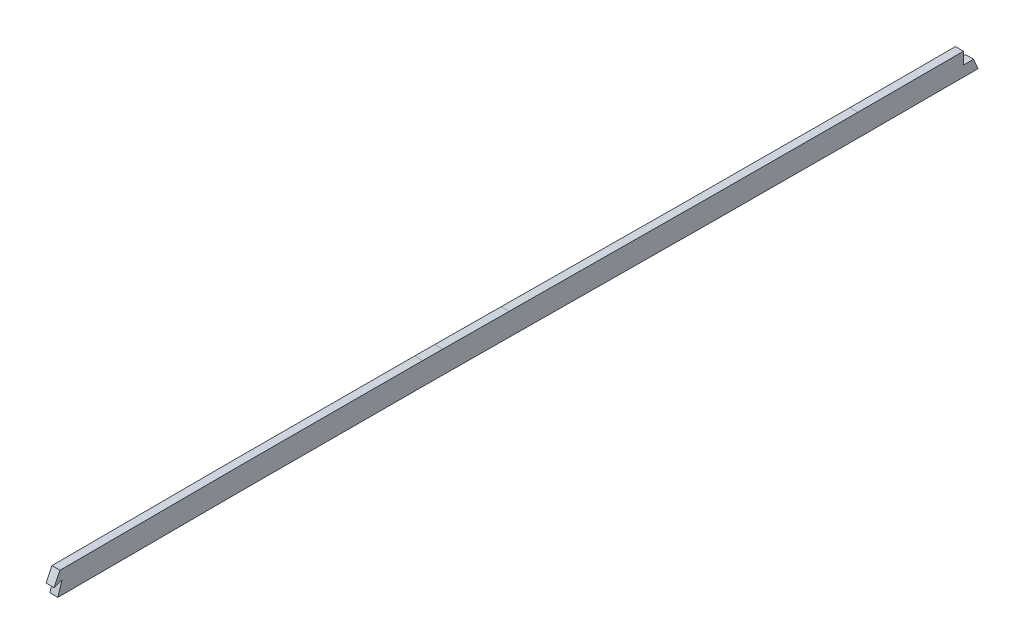
ISO-10303-21;
HEADER;
FILE_DESCRIPTION(('STEP AP214'),'2;1');
FILE_NAME('part.step','',(''),(''),'','','');
FILE_SCHEMA(('AUTOMOTIVE_DESIGN { 1 0 10303 214 1 1 1 1 }'));
ENDSEC;
DATA;
#1=APPLICATION_CONTEXT('core data for automotive mechanical design processes');
#2=APPLICATION_PROTOCOL_DEFINITION('international standard','automotive_design',2000,#1);
#3=PRODUCT_CONTEXT('',#1,'mechanical');
#4=PRODUCT('Part','Part','',(#3));
#5=PRODUCT_RELATED_PRODUCT_CATEGORY('part','',(#4));
#6=PRODUCT_DEFINITION_FORMATION('','',#4);
#7=PRODUCT_DEFINITION_CONTEXT('part definition',#1,'design');
#8=PRODUCT_DEFINITION('design','',#6,#7);
#9=PRODUCT_DEFINITION_SHAPE('','',#8);
#10=(LENGTH_UNIT() NAMED_UNIT(*) SI_UNIT(.MILLI.,.METRE.));
#11=(NAMED_UNIT(*) PLANE_ANGLE_UNIT() SI_UNIT($,.RADIAN.));
#12=(NAMED_UNIT(*) SI_UNIT($,.STERADIAN.) SOLID_ANGLE_UNIT());
#13=UNCERTAINTY_MEASURE_WITH_UNIT(LENGTH_MEASURE(1.E-05),#10,'distance_accuracy_value','');
#14=(GEOMETRIC_REPRESENTATION_CONTEXT(3) GLOBAL_UNCERTAINTY_ASSIGNED_CONTEXT((#13)) GLOBAL_UNIT_ASSIGNED_CONTEXT((#10,
#11,#12)) REPRESENTATION_CONTEXT('',''));
#15=CARTESIAN_POINT('',(0.,0.,0.));
#16=DIRECTION('',(0.,0.,1.));
#17=DIRECTION('',(1.,0.,0.));
#18=AXIS2_PLACEMENT_3D('',#15,#16,#17);
#19=CARTESIAN_POINT('',(-1.5875,129.578409662079,-768.73504864351));
#20=CARTESIAN_POINT('',(-1.5875,129.562145519502,-797.222409768422));
#21=CARTESIAN_POINT('',(-1.5875,129.725124502773,-854.203652026176));
#22=CARTESIAN_POINT('',(-1.5875,130.236578517582,-939.635195481091));
#23=CARTESIAN_POINT('',(-1.5875,130.524931921096,-1024.99295846428));
#24=CARTESIAN_POINT('',(-1.5875,130.426767717012,-1081.93761233553));
#25=CARTESIAN_POINT('',(-1.5875,130.38454577414,-1110.40497093677));
#26=B_SPLINE_CURVE_WITH_KNOTS('',3,(#19,#20,#21,#22,#23,#24,#25),.UNSPECIFIED.,.F.,.F.,(4,1,1,1,
4),(0.,0.25,0.5,0.75,1.),.UNSPECIFIED.);
#27=DIRECTION('',(1.,0.,0.));
#28=VECTOR('',#27,1.);
#29=SURFACE_OF_LINEAR_EXTRUSION('',#26,#28);
#30=DIRECTION('',(1.,0.,0.));
#31=VECTOR('',#30,1.);
#32=CARTESIAN_POINT('',(-6.0325,129.632745347889,-816.238424634587));
#33=LINE('',#32,#31);
#34=CARTESIAN_POINT('',(-1.5875,129.632745347889,-816.238424634587));
#35=VERTEX_POINT('',#34);
#36=CARTESIAN_POINT('',(1.5875,129.632745347889,-816.238424634587));
#37=VERTEX_POINT('',#36);
#38=EDGE_CURVE('E441',#35,#37,#33,.T.);
#39=ORIENTED_EDGE('',*,*,#38,.T.);
#40=CARTESIAN_POINT('',(1.5875,129.578409662079,-768.73504864351));
#41=CARTESIAN_POINT('',(1.5875,129.562145519502,-797.222409768422));
#42=CARTESIAN_POINT('',(1.5875,129.725124502773,-854.203652026176));
#43=CARTESIAN_POINT('',(1.5875,130.236578517582,-939.635195481091));
#44=CARTESIAN_POINT('',(1.5875,130.524931921096,-1024.99295846428));
#45=CARTESIAN_POINT('',(1.5875,130.426767717012,-1081.93761233553));
#46=CARTESIAN_POINT('',(1.5875,130.38454577414,-1110.40497093677));
#47=B_SPLINE_CURVE_WITH_KNOTS('',3,(#40,#41,#42,#43,#44,#45,#46),.UNSPECIFIED.,.F.,.F.,(4,1,1,1,
4),(0.,0.25,0.5,0.75,1.),.UNSPECIFIED.);
#48=CARTESIAN_POINT('',(1.5875,129.578409662079,-768.735048644377));
#49=VERTEX_POINT('',#48);
#50=EDGE_CURVE('E341',#49,#37,#47,.T.);
#51=ORIENTED_EDGE('',*,*,#50,.F.);
#52=DIRECTION('',(1.,0.,0.));
#53=VECTOR('',#52,1.);
#54=CARTESIAN_POINT('',(-1.5875,129.578409662079,-768.735048644377));
#55=LINE('',#54,#53);
#56=CARTESIAN_POINT('',(-1.5875,129.578409662079,-768.735048644377));
#57=VERTEX_POINT('',#56);
#58=EDGE_CURVE('E11',#57,#49,#55,.T.);
#59=ORIENTED_EDGE('',*,*,#58,.F.);
#60=EDGE_CURVE('E396',#57,#35,#26,.T.);
#61=ORIENTED_EDGE('',*,*,#60,.T.);
#62=EDGE_LOOP('',(#39,#51,#59,#61));
#63=FACE_BOUND('',#62,.T.);
#64=ADVANCED_FACE('F40',(#63),#29,.T.);
#65=CARTESIAN_POINT('',(-1.5875,130.361698314933,-630.710339689829));
#66=CARTESIAN_POINT('',(-1.5875,130.273644325736,-642.206126488968));
#67=CARTESIAN_POINT('',(-1.5875,130.083785310893,-665.193556095248));
#68=CARTESIAN_POINT('',(-1.5875,129.819212192808,-699.699077952938));
#69=CARTESIAN_POINT('',(-1.5875,129.634735150848,-734.215040109625));
#70=CARTESIAN_POINT('',(-1.5875,129.584978980173,-757.22859707547));
#71=CARTESIAN_POINT('',(-1.5875,129.578409662079,-768.735048644377));
#72=B_SPLINE_CURVE_WITH_KNOTS('',3,(#65,#66,#67,#68,#69,#70,#71),.UNSPECIFIED.,.F.,.F.,(4,1,1,1,
4),(0.,0.25,0.5,0.75,1.),.UNSPECIFIED.);
#73=DIRECTION('',(1.,0.,0.));
#74=VECTOR('',#73,1.);
#75=SURFACE_OF_LINEAR_EXTRUSION('',#72,#74);
#76=CARTESIAN_POINT('',(1.5875,130.361698314933,-630.710339689829));
#77=CARTESIAN_POINT('',(1.5875,130.273644325736,-642.206126488968));
#78=CARTESIAN_POINT('',(1.5875,130.083785310893,-665.193556095248));
#79=CARTESIAN_POINT('',(1.5875,129.819212192808,-699.699077952938));
#80=CARTESIAN_POINT('',(1.5875,129.634735150848,-734.215040109625));
#81=CARTESIAN_POINT('',(1.5875,129.584978980173,-757.22859707547));
#82=CARTESIAN_POINT('',(1.5875,129.578409662079,-768.735048644377));
#83=B_SPLINE_CURVE_WITH_KNOTS('',3,(#76,#77,#78,#79,#80,#81,#82),.UNSPECIFIED.,.F.,.F.,(4,1,1,1,
4),(0.,0.25,0.5,0.75,1.),.UNSPECIFIED.);
#84=CARTESIAN_POINT('',(1.5875,130.361698324048,-630.710338499818));
#85=VERTEX_POINT('',#84);
#86=EDGE_CURVE('E347',#85,#49,#83,.T.);
#87=ORIENTED_EDGE('',*,*,#86,.F.);
#88=DIRECTION('',(1.,0.,0.));
#89=VECTOR('',#88,1.);
#90=CARTESIAN_POINT('',(-1.5875,130.361698324048,-630.710338499818));
#91=LINE('',#90,#89);
#92=CARTESIAN_POINT('',(-1.5875,130.361698324048,-630.710338499818));
#93=VERTEX_POINT('',#92);
#94=EDGE_CURVE('E53',#93,#85,#91,.T.);
#95=ORIENTED_EDGE('',*,*,#94,.F.);
#96=EDGE_CURVE('E406',#93,#57,#72,.T.);
#97=ORIENTED_EDGE('',*,*,#96,.T.);
#98=ORIENTED_EDGE('',*,*,#58,.T.);
#99=EDGE_LOOP('',(#87,#95,#97,#98));
#100=FACE_BOUND('',#99,.T.);
#101=ADVANCED_FACE('F423',(#100),#75,.T.);
#102=CARTESIAN_POINT('',(-1.5875,130.543849997921,-604.460914456542));
#103=CARTESIAN_POINT('',(-1.5875,130.530551361573,-606.648150430552));
#104=CARTESIAN_POINT('',(-1.5875,130.502867011444,-611.022503016699));
#105=CARTESIAN_POINT('',(-1.5875,130.458405464686,-617.584689428613));
#106=CARTESIAN_POINT('',(-1.5875,130.411339888287,-624.147187284148));
#107=CARTESIAN_POINT('',(-1.5875,130.378455493813,-628.522663801703));
#108=CARTESIAN_POINT('',(-1.5875,130.361698324048,-630.710338499818));
#109=B_SPLINE_CURVE_WITH_KNOTS('',3,(#102,#103,#104,#105,#106,#107,#108),.UNSPECIFIED.,.F.,.F.,
(4,1,1,1,4),(-7.08953406117068E-07,0.249999468284945,0.499999645523297,0.749999822761648,1.),.UNSPECIFIED.);
#110=DIRECTION('',(1.,0.,0.));
#111=VECTOR('',#110,1.);
#112=SURFACE_OF_LINEAR_EXTRUSION('',#109,#111);
#113=CARTESIAN_POINT('',(1.5875,130.543849997921,-604.460914456542));
#114=CARTESIAN_POINT('',(1.5875,130.530551361573,-606.648150430552));
#115=CARTESIAN_POINT('',(1.5875,130.502867011444,-611.022503016699));
#116=CARTESIAN_POINT('',(1.5875,130.458405464686,-617.584689428613));
#117=CARTESIAN_POINT('',(1.5875,130.411339888287,-624.147187284148));
#118=CARTESIAN_POINT('',(1.5875,130.378455493813,-628.522663801703));
#119=CARTESIAN_POINT('',(1.5875,130.361698324048,-630.710338499818));
#120=B_SPLINE_CURVE_WITH_KNOTS('',3,(#113,#114,#115,#116,#117,#118,#119),.UNSPECIFIED.,.F.,.F.,
(4,1,1,1,4),(-7.08953406117068E-07,0.249999468284945,0.499999645523297,0.749999822761648,1.),.UNSPECIFIED.);
#121=CARTESIAN_POINT('',(1.5875,130.543849997922,-604.460914456541));
#122=VERTEX_POINT('',#121);
#123=EDGE_CURVE('E353',#122,#85,#120,.T.);
#124=ORIENTED_EDGE('',*,*,#123,.F.);
#125=DIRECTION('',(1.,0.,0.));
#126=VECTOR('',#125,1.);
#127=CARTESIAN_POINT('',(-1.5875,130.543849997922,-604.460914456541));
#128=LINE('',#127,#126);
#129=CARTESIAN_POINT('',(-1.5875,130.543849997922,-604.460914456541));
#130=VERTEX_POINT('',#129);
#131=EDGE_CURVE('E366',#130,#122,#128,.T.);
#132=ORIENTED_EDGE('',*,*,#131,.F.);
#133=EDGE_CURVE('E416',#130,#93,#109,.T.);
#134=ORIENTED_EDGE('',*,*,#133,.T.);
#135=ORIENTED_EDGE('',*,*,#94,.T.);
#136=EDGE_LOOP('',(#124,#132,#134,#135));
#137=FACE_BOUND('',#136,.T.);
#138=ADVANCED_FACE('F426',(#137),#112,.T.);
#139=CARTESIAN_POINT('',(-1.5875,-12134.2803031365,-529.837683130908));
#140=DIRECTION('',(1.,0.,0.));
#141=DIRECTION('',(0.,0.,-1.));
#142=AXIS2_PLACEMENT_3D('',#139,#140,#141);
#143=CYLINDRICAL_SURFACE('',#142,12265.0511671971);
#144=CARTESIAN_POINT('',(1.5875,-12134.2803031365,-529.837683130908));
#145=DIRECTION('',(1.,0.,0.));
#146=DIRECTION('',(0.,0.,-1.));
#147=AXIS2_PLACEMENT_3D('',#144,#145,#146);
#148=CIRCLE('',#147,12265.0511671971);
#149=CARTESIAN_POINT('',(1.5875,130.589510646411,-596.53539613264));
#150=VERTEX_POINT('',#149);
#151=EDGE_CURVE('E380',#122,#150,#148,.T.);
#152=ORIENTED_EDGE('',*,*,#151,.T.);
#153=DIRECTION('',(1.,0.,0.));
#154=VECTOR('',#153,1.);
#155=CARTESIAN_POINT('',(-1.5875,130.589510646411,-596.53539613264));
#156=LINE('',#155,#154);
#157=CARTESIAN_POINT('',(-1.5875,130.589510646411,-596.53539613264));
#158=VERTEX_POINT('',#157);
#159=EDGE_CURVE('E322',#158,#150,#156,.T.);
#160=ORIENTED_EDGE('',*,*,#159,.F.);
#161=CARTESIAN_POINT('',(-1.5875,-12134.2803031365,-529.837683130908));
#162=DIRECTION('',(1.,0.,0.));
#163=DIRECTION('',(0.,0.,-1.));
#164=AXIS2_PLACEMENT_3D('',#161,#162,#163);
#165=CIRCLE('',#164,12265.0511671971);
#166=EDGE_CURVE('E590',#130,#158,#165,.T.);
#167=ORIENTED_EDGE('',*,*,#166,.F.);
#168=ORIENTED_EDGE('',*,*,#131,.T.);
#169=EDGE_LOOP('',(#152,#160,#167,#168));
#170=FACE_BOUND('',#169,.T.);
#171=ADVANCED_FACE('F381',(#170),#143,.F.);
#172=CARTESIAN_POINT('',(-1.5875,130.467204420765,-436.155274925161));
#173=CARTESIAN_POINT('',(-1.5875,130.500683926665,-449.528322362865));
#174=CARTESIAN_POINT('',(-1.5875,130.546633814902,-476.275740381745));
#175=CARTESIAN_POINT('',(-1.5875,130.728798696969,-516.38896028979));
#176=CARTESIAN_POINT('',(-1.5875,130.759667497616,-556.456290894868));
#177=CARTESIAN_POINT('',(-1.5875,130.662101975378,-583.176533447977));
#178=CARTESIAN_POINT('',(-1.5875,130.589510646413,-596.53539613264));
#179=B_SPLINE_CURVE_WITH_KNOTS('',3,(#172,#173,#174,#175,#176,#177,#178),.UNSPECIFIED.,.F.,.F.,
(4,1,1,1,4),(0.,0.249999972809526,0.499999945619052,0.749999918428578,0.999999891238104),.UNSPECIFIED.);
#180=DIRECTION('',(1.,0.,0.));
#181=VECTOR('',#180,1.);
#182=SURFACE_OF_LINEAR_EXTRUSION('',#179,#181);
#183=DIRECTION('',(1.,0.,0.));
#184=VECTOR('',#183,1.);
#185=CARTESIAN_POINT('',(-6.0325,130.504363999303,-452.268768997127));
#186=LINE('',#185,#184);
#187=CARTESIAN_POINT('',(-1.5875,130.504363999303,-452.268768997127));
#188=VERTEX_POINT('',#187);
#189=CARTESIAN_POINT('',(1.5875,130.504363999303,-452.268768997127));
#190=VERTEX_POINT('',#189);
#191=EDGE_CURVE('E178',#188,#190,#186,.T.);
#192=ORIENTED_EDGE('',*,*,#191,.F.);
#193=EDGE_CURVE('E293',#188,#158,#179,.T.);
#194=ORIENTED_EDGE('',*,*,#193,.T.);
#195=ORIENTED_EDGE('',*,*,#159,.T.);
#196=CARTESIAN_POINT('',(1.5875,130.467204420765,-436.155274925161));
#197=CARTESIAN_POINT('',(1.5875,130.500683926665,-449.528322362865));
#198=CARTESIAN_POINT('',(1.5875,130.546633814902,-476.275740381745));
#199=CARTESIAN_POINT('',(1.5875,130.728798696969,-516.38896028979));
#200=CARTESIAN_POINT('',(1.5875,130.759667497616,-556.456290894868));
#201=CARTESIAN_POINT('',(1.5875,130.662101975378,-583.176533447977));
#202=CARTESIAN_POINT('',(1.5875,130.589510646413,-596.53539613264));
#203=B_SPLINE_CURVE_WITH_KNOTS('',3,(#196,#197,#198,#199,#200,#201,#202),.UNSPECIFIED.,.F.,.F.,
(4,1,1,1,4),(0.,0.249999972809526,0.499999945619052,0.749999918428578,0.999999891238104),.UNSPECIFIED.);
#204=EDGE_CURVE('E188',#190,#150,#203,.T.);
#205=ORIENTED_EDGE('',*,*,#204,.F.);
#206=EDGE_LOOP('',(#192,#194,#195,#205));
#207=FACE_BOUND('',#206,.T.);
#208=ADVANCED_FACE('F305',(#207),#182,.T.);
#209=CARTESIAN_POINT('',(-1.5875,139.357176561668,-436.133018825636));
#210=CARTESIAN_POINT('',(-1.5875,139.390650738922,-449.503937790031));
#211=CARTESIAN_POINT('',(-1.5875,139.412366015163,-462.874888934299));
#212=CARTESIAN_POINT('',(-1.5875,139.49855597718,-489.616659390037));
#213=CARTESIAN_POINT('',(-1.5875,139.559076552839,-502.98749712742));
#214=CARTESIAN_POINT('',(-1.5875,139.628029753523,-529.729299232511));
#215=CARTESIAN_POINT('',(-1.5875,139.639230481059,-543.100240500853));
#216=CARTESIAN_POINT('',(-1.5875,139.601013959494,-569.842121019924));
#217=CARTESIAN_POINT('',(-1.5875,139.552035302235,-583.212960696413));
#218=CARTESIAN_POINT('',(-1.5875,139.479379303594,-596.583720643824));
#219=B_SPLINE_CURVE_WITH_KNOTS('',3,(#209,#210,#211,#212,#213,#214,#215,#216,#217,#218),
.UNSPECIFIED.,.F.,.F.,(4,2,2,2,4),(0.,0.25,0.5,0.75,1.),.UNSPECIFIED.);
#220=DIRECTION('',(1.,0.,0.));
#221=VECTOR('',#220,1.);
#222=SURFACE_OF_LINEAR_EXTRUSION('',#219,#221);
#223=CARTESIAN_POINT('',(-1.5875,139.479379303594,-596.583720643824));
#224=CARTESIAN_POINT('',(-1.5875,139.552035302235,-583.212960696413));
#225=CARTESIAN_POINT('',(-1.5875,139.601013959494,-569.842121019924));
#226=CARTESIAN_POINT('',(-1.5875,139.639230481059,-543.100240500853));
#227=CARTESIAN_POINT('',(-1.5875,139.628029753523,-529.729299232511));
#228=CARTESIAN_POINT('',(-1.5875,139.559076552839,-502.98749712742));
#229=CARTESIAN_POINT('',(-1.5875,139.49855597718,-489.616659390037));
#230=CARTESIAN_POINT('',(-1.5875,139.430581917439,-468.526654707202));
#231=CARTESIAN_POINT('',(-1.5875,139.412828364317,-460.807513283317));
#232=CARTESIAN_POINT('',(-1.5875,139.395824208684,-453.088368765007));
#233=B_SPLINE_CURVE_WITH_KNOTS('',3,(#223,#224,#225,#226,#227,#228,#229,#230,#231,#232),
.UNSPECIFIED.,.F.,.F.,(4,2,2,2,4),(0.105672991664054,0.355672991664054,0.605672991664054,
0.855672991664054,1.),.UNSPECIFIED.);
#234=CARTESIAN_POINT('',(-1.5875,139.395862417181,-453.088368680839));
#235=VERTEX_POINT('',#234);
#236=CARTESIAN_POINT('',(-1.5875,139.479379303594,-596.583720643825));
#237=VERTEX_POINT('',#236);
#238=EDGE_CURVE('E176',#235,#237,#233,.F.);
#239=ORIENTED_EDGE('',*,*,#238,.F.);
#240=DIRECTION('',(1.,0.,0.));
#241=VECTOR('',#240,1.);
#242=CARTESIAN_POINT('',(-6.0325,139.395824167336,-453.088349994794));
#243=LINE('',#242,#241);
#244=CARTESIAN_POINT('',(1.5875,139.395807036751,-453.088341588638));
#245=VERTEX_POINT('',#244);
#246=EDGE_CURVE('E162',#235,#245,#243,.T.);
#247=ORIENTED_EDGE('',*,*,#246,.T.);
#248=CARTESIAN_POINT('',(1.5875,139.395824148735,-453.08834155065));
#249=CARTESIAN_POINT('',(1.5875,139.412828322589,-460.80749514042));
#250=CARTESIAN_POINT('',(1.5875,139.430581888201,-468.526645635779));
#251=CARTESIAN_POINT('',(1.5875,139.49855597718,-489.616659390037));
#252=CARTESIAN_POINT('',(1.5875,139.559076552839,-502.98749712742));
#253=CARTESIAN_POINT('',(1.5875,139.628029753523,-529.729299232511));
#254=CARTESIAN_POINT('',(1.5875,139.639230481059,-543.100240500853));
#255=CARTESIAN_POINT('',(1.5875,139.601013959494,-569.842121019924));
#256=CARTESIAN_POINT('',(1.5875,139.552035302235,-583.212960696413));
#257=CARTESIAN_POINT('',(1.5875,139.479379303594,-596.583720643824));
#258=B_SPLINE_CURVE_WITH_KNOTS('',3,(#248,#249,#250,#251,#252,#253,#254,#255,#256,#257),
.UNSPECIFIED.,.F.,.F.,(4,2,2,2,4),(0.105672822052567,0.25,0.5,0.75,1.),.UNSPECIFIED.);
#259=CARTESIAN_POINT('',(1.5875,139.479379303594,-596.583720643825));
#260=VERTEX_POINT('',#259);
#261=EDGE_CURVE('E173',#245,#260,#258,.T.);
#262=ORIENTED_EDGE('',*,*,#261,.T.);
#263=DIRECTION('',(1.,0.,0.));
#264=VECTOR('',#263,1.);
#265=CARTESIAN_POINT('',(-1.5875,139.479379303594,-596.583720643825));
#266=LINE('',#265,#264);
#267=EDGE_CURVE('E314',#237,#260,#266,.T.);
#268=ORIENTED_EDGE('',*,*,#267,.F.);
#269=EDGE_LOOP('',(#239,#247,#262,#268));
#270=FACE_BOUND('',#269,.T.);
#271=ADVANCED_FACE('F171',(#270),#222,.F.);
#272=CARTESIAN_POINT('',(-1.5875,-12134.2803031365,-529.837683130908));
#273=DIRECTION('',(1.,0.,0.));
#274=DIRECTION('',(0.,0.,-1.));
#275=AXIS2_PLACEMENT_3D('',#272,#273,#274);
#276=CYLINDRICAL_SURFACE('',#275,12273.9411671971);
#277=CARTESIAN_POINT('',(1.5875,-12134.2803031365,-529.837683130908));
#278=DIRECTION('',(1.,0.,0.));
#279=DIRECTION('',(0.,0.,-1.));
#280=AXIS2_PLACEMENT_3D('',#277,#278,#279);
#281=CIRCLE('',#280,12273.9411671971);
#282=CARTESIAN_POINT('',(1.5875,139.433685567646,-604.51498425923));
#283=VERTEX_POINT('',#282);
#284=EDGE_CURVE('E186',#283,#260,#281,.T.);
#285=ORIENTED_EDGE('',*,*,#284,.F.);
#286=DIRECTION('',(1.,0.,0.));
#287=VECTOR('',#286,1.);
#288=CARTESIAN_POINT('',(-1.5875,139.433685567646,-604.51498425923));
#289=LINE('',#288,#287);
#290=CARTESIAN_POINT('',(-1.5875,139.433685567646,-604.51498425923));
#291=VERTEX_POINT('',#290);
#292=EDGE_CURVE('E323',#291,#283,#289,.T.);
#293=ORIENTED_EDGE('',*,*,#292,.F.);
#294=CARTESIAN_POINT('',(-1.5875,-12134.2803031365,-529.837683130908));
#295=DIRECTION('',(1.,0.,0.));
#296=DIRECTION('',(0.,0.,-1.));
#297=AXIS2_PLACEMENT_3D('',#294,#295,#296);
#298=CIRCLE('',#297,12273.9411671971);
#299=EDGE_CURVE('E326',#291,#237,#298,.T.);
#300=ORIENTED_EDGE('',*,*,#299,.T.);
#301=ORIENTED_EDGE('',*,*,#267,.T.);
#302=EDGE_LOOP('',(#285,#293,#300,#301));
#303=FACE_BOUND('',#302,.T.);
#304=ADVANCED_FACE('F304',(#303),#276,.T.);
#305=CARTESIAN_POINT('',(-1.5875,139.433685567648,-604.51498425923));
#306=CARTESIAN_POINT('',(-1.5875,139.400696354289,-609.940743135861));
#307=CARTESIAN_POINT('',(-1.5875,139.342071397165,-618.69524242686));
#308=CARTESIAN_POINT('',(-1.5875,139.276935028131,-627.449694696427));
#309=CARTESIAN_POINT('',(-1.5875,139.251437535507,-630.778432201892));
#310=B_SPLINE_CURVE_WITH_KNOTS('',3,(#305,#306,#307,#308,#309),.UNSPECIFIED.,.F.,.F.,(4,1,4),
(0.,0.619765686067694,1.),.UNSPECIFIED.);
#311=DIRECTION('',(1.,0.,0.));
#312=VECTOR('',#311,1.);
#313=SURFACE_OF_LINEAR_EXTRUSION('',#310,#312);
#314=CARTESIAN_POINT('',(1.5875,139.433685567648,-604.51498425923));
#315=CARTESIAN_POINT('',(1.5875,139.400696354289,-609.940743135861));
#316=CARTESIAN_POINT('',(1.5875,139.342071397165,-618.69524242686));
#317=CARTESIAN_POINT('',(1.5875,139.276935028131,-627.449694696427));
#318=CARTESIAN_POINT('',(1.5875,139.251437535507,-630.778432201892));
#319=B_SPLINE_CURVE_WITH_KNOTS('',3,(#314,#315,#316,#317,#318),.UNSPECIFIED.,.F.,.F.,(4,1,4),
(0.,0.619765686067694,1.),.UNSPECIFIED.);
#320=CARTESIAN_POINT('',(1.5875,139.251437535507,-630.778432201892));
#321=VERTEX_POINT('',#320);
#322=EDGE_CURVE('E507',#283,#321,#319,.T.);
#323=ORIENTED_EDGE('',*,*,#322,.T.);
#324=DIRECTION('',(1.,0.,0.));
#325=VECTOR('',#324,1.);
#326=CARTESIAN_POINT('',(-1.5875,139.251437535507,-630.778432201892));
#327=LINE('',#326,#325);
#328=CARTESIAN_POINT('',(-1.5875,139.251437535507,-630.778432201892));
#329=VERTEX_POINT('',#328);
#330=EDGE_CURVE('E514',#329,#321,#327,.T.);
#331=ORIENTED_EDGE('',*,*,#330,.F.);
#332=CARTESIAN_POINT('',(-1.5875,139.251437535507,-630.778432201892));
#333=CARTESIAN_POINT('',(-1.5875,139.276935028131,-627.449694696427));
#334=CARTESIAN_POINT('',(-1.5875,139.342071397165,-618.69524242686));
#335=CARTESIAN_POINT('',(-1.5875,139.400696354289,-609.940743135861));
#336=CARTESIAN_POINT('',(-1.5875,139.433685567648,-604.51498425923));
#337=B_SPLINE_CURVE_WITH_KNOTS('',3,(#332,#333,#334,#335,#336),.UNSPECIFIED.,.F.,.F.,(4,1,4),
(0.,0.380234313932306,1.),.UNSPECIFIED.);
#338=EDGE_CURVE('E329',#291,#329,#337,.F.);
#339=ORIENTED_EDGE('',*,*,#338,.F.);
#340=ORIENTED_EDGE('',*,*,#292,.T.);
#341=EDGE_LOOP('',(#323,#331,#339,#340));
#342=FACE_BOUND('',#341,.T.);
#343=ADVANCED_FACE('F267',(#342),#313,.F.);
#344=CARTESIAN_POINT('',(-1.5875,139.251437535507,-630.778432201892));
#345=CARTESIAN_POINT('',(-1.5875,139.075315663891,-653.771819613578));
#346=CARTESIAN_POINT('',(-1.5875,138.871740519015,-676.765000849425));
#347=CARTESIAN_POINT('',(-1.5875,138.647690701073,-711.255349111164));
#348=CARTESIAN_POINT('',(-1.5875,138.586174182217,-722.752238944669));
#349=CARTESIAN_POINT('',(-1.5875,138.499784896072,-745.746099073854));
#350=CARTESIAN_POINT('',(-1.5875,138.474972157952,-757.243084258704));
#351=CARTESIAN_POINT('',(-1.5875,138.468408213209,-768.740124164662));
#352=B_SPLINE_CURVE_WITH_KNOTS('',3,(#344,#345,#346,#347,#348,#349,#350,#351),.UNSPECIFIED.,.F.,
.F.,(4,2,2,4),(0.,0.5,0.75,1.),.UNSPECIFIED.);
#353=DIRECTION('',(1.,0.,0.));
#354=VECTOR('',#353,1.);
#355=SURFACE_OF_LINEAR_EXTRUSION('',#352,#354);
#356=CARTESIAN_POINT('',(1.5875,139.251437535507,-630.778432201892));
#357=CARTESIAN_POINT('',(1.5875,139.075315663891,-653.771819613578));
#358=CARTESIAN_POINT('',(1.5875,138.871740519015,-676.765000849425));
#359=CARTESIAN_POINT('',(1.5875,138.647690701073,-711.255349111164));
#360=CARTESIAN_POINT('',(1.5875,138.586174182217,-722.752238944669));
#361=CARTESIAN_POINT('',(1.5875,138.499784896072,-745.746099073854));
#362=CARTESIAN_POINT('',(1.5875,138.474972157952,-757.243084258704));
#363=CARTESIAN_POINT('',(1.5875,138.468408213209,-768.740124164662));
#364=B_SPLINE_CURVE_WITH_KNOTS('',3,(#356,#357,#358,#359,#360,#361,#362,#363),.UNSPECIFIED.,.F.,
.F.,(4,2,2,4),(0.,0.5,0.75,1.),.UNSPECIFIED.);
#365=CARTESIAN_POINT('',(1.5875,138.468408213209,-768.740124164662));
#366=VERTEX_POINT('',#365);
#367=EDGE_CURVE('E501',#321,#366,#364,.T.);
#368=ORIENTED_EDGE('',*,*,#367,.T.);
#369=DIRECTION('',(1.,0.,0.));
#370=VECTOR('',#369,1.);
#371=CARTESIAN_POINT('',(-1.5875,138.468408213209,-768.740124164662));
#372=LINE('',#371,#370);
#373=CARTESIAN_POINT('',(-1.5875,138.468408213209,-768.740124164662));
#374=VERTEX_POINT('',#373);
#375=EDGE_CURVE('E255',#374,#366,#372,.T.);
#376=ORIENTED_EDGE('',*,*,#375,.F.);
#377=CARTESIAN_POINT('',(-1.5875,138.468408213209,-768.740124164662));
#378=CARTESIAN_POINT('',(-1.5875,138.474972157952,-757.243084258704));
#379=CARTESIAN_POINT('',(-1.5875,138.499784896072,-745.746099073854));
#380=CARTESIAN_POINT('',(-1.5875,138.586174182217,-722.752238944669));
#381=CARTESIAN_POINT('',(-1.5875,138.647690701073,-711.255349111164));
#382=CARTESIAN_POINT('',(-1.5875,138.871740519015,-676.765000849425));
#383=CARTESIAN_POINT('',(-1.5875,139.075315663891,-653.771819613578));
#384=CARTESIAN_POINT('',(-1.5875,139.251437535507,-630.778432201892));
#385=B_SPLINE_CURVE_WITH_KNOTS('',3,(#377,#378,#379,#380,#381,#382,#383,#384),.UNSPECIFIED.,.F.,
.F.,(4,2,2,4),(0.,0.25,0.5,1.),.UNSPECIFIED.);
#386=EDGE_CURVE('E239',#329,#374,#385,.F.);
#387=ORIENTED_EDGE('',*,*,#386,.F.);
#388=ORIENTED_EDGE('',*,*,#330,.T.);
#389=EDGE_LOOP('',(#368,#376,#387,#388));
#390=FACE_BOUND('',#389,.T.);
#391=ADVANCED_FACE('F257',(#390),#355,.F.);
#392=CARTESIAN_POINT('',(-1.5875,138.468408213209,-768.740124164662));
#393=CARTESIAN_POINT('',(-1.5875,138.460280143351,-782.976796045164));
#394=CARTESIAN_POINT('',(-1.5875,138.479500079153,-797.213453801459));
#395=CARTESIAN_POINT('',(-1.5875,138.549690295794,-825.686695050945));
#396=CARTESIAN_POINT('',(-1.5875,138.600062665371,-839.923258915609));
#397=CARTESIAN_POINT('',(-1.5875,138.719026332735,-868.396318955595));
#398=CARTESIAN_POINT('',(-1.5875,138.78960797213,-882.632808961988));
#399=CARTESIAN_POINT('',(-1.5875,138.939594728624,-911.105746116677));
#400=CARTESIAN_POINT('',(-1.5875,139.018479562576,-925.342197006862));
#401=CARTESIAN_POINT('',(-1.5875,139.160090703363,-953.815172229786));
#402=CARTESIAN_POINT('',(-1.5875,139.222241505408,-968.051699178267));
#403=CARTESIAN_POINT('',(-1.5875,139.309954069578,-996.524919377054));
#404=CARTESIAN_POINT('',(-1.5875,139.335014039255,-1010.76160551679));
#405=CARTESIAN_POINT('',(-1.5875,139.349647551589,-1039.23491287134));
#406=CARTESIAN_POINT('',(-1.5875,139.340493535119,-1053.47156286932));
#407=CARTESIAN_POINT('',(-1.5875,139.313691901865,-1081.94486096797));
#408=CARTESIAN_POINT('',(-1.5875,139.295651369593,-1096.18150898086));
#409=CARTESIAN_POINT('',(-1.5875,139.27453599607,-1110.41815630688));
#410=B_SPLINE_CURVE_WITH_KNOTS('',3,(#392,#393,#394,#395,#396,#397,#398,#399,#400,#401,#402,
#403,#404,#405,#406,#407,#408,#409),.UNSPECIFIED.,.F.,.F.,(4,2,2,2,2,2,2,2,4),(0.,0.125,
0.250000000000001,0.375000000000001,0.500000000000002,0.625000000000002,0.750000000000003,
0.875000000000001,1.),.UNSPECIFIED.);
#411=DIRECTION('',(1.,0.,0.));
#412=VECTOR('',#411,1.);
#413=SURFACE_OF_LINEAR_EXTRUSION('',#410,#412);
#414=CARTESIAN_POINT('',(1.5875,138.468408213209,-768.740124164662));
#415=CARTESIAN_POINT('',(1.5875,138.460467035284,-782.649446602985));
#416=CARTESIAN_POINT('',(1.5875,138.478630674731,-796.558755559161));
#417=CARTESIAN_POINT('',(1.5875,138.512199639149,-810.468029576684));
#418=B_SPLINE_CURVE_WITH_KNOTS('',3,(#414,#415,#416,#417),.UNSPECIFIED.,.F.,.F.,(4,4),(0.,
0.122125825430566),.UNSPECIFIED.);
#419=CARTESIAN_POINT('',(1.5875,138.512200198071,-810.468029575336));
#420=VERTEX_POINT('',#419);
#421=EDGE_CURVE('E497',#366,#420,#418,.T.);
#422=ORIENTED_EDGE('',*,*,#421,.T.);
#423=DIRECTION('',(1.,0.,0.));
#424=VECTOR('',#423,1.);
#425=CARTESIAN_POINT('',(-1.5875,138.512199639142,-810.468029573986));
#426=LINE('',#425,#424);
#427=CARTESIAN_POINT('',(-1.5875,138.512200810306,-810.468029573986));
#428=VERTEX_POINT('',#427);
#429=EDGE_CURVE('E69',#420,#428,#426,.F.);
#430=ORIENTED_EDGE('',*,*,#429,.T.);
#431=CARTESIAN_POINT('',(-1.5875,138.512199639149,-810.468029576814));
#432=CARTESIAN_POINT('',(-1.5875,138.478630674731,-796.558755559248));
#433=CARTESIAN_POINT('',(-1.5875,138.460467035284,-782.649446603029));
#434=CARTESIAN_POINT('',(-1.5875,138.468408213209,-768.740124164662));
#435=B_SPLINE_CURVE_WITH_KNOTS('',3,(#431,#432,#433,#434),.UNSPECIFIED.,.F.,.F.,(4,4),(0.,
0.122125825430947),.UNSPECIFIED.);
#436=EDGE_CURVE('E339',#374,#428,#435,.F.);
#437=ORIENTED_EDGE('',*,*,#436,.F.);
#438=ORIENTED_EDGE('',*,*,#375,.T.);
#439=EDGE_LOOP('',(#422,#430,#437,#438));
#440=FACE_BOUND('',#439,.T.);
#441=ADVANCED_FACE('F42',(#440),#413,.F.);
#442=CARTESIAN_POINT('',(-1.5875,0.,0.));
#443=DIRECTION('',(1.,0.,0.));
#444=DIRECTION('',(0.,0.,-1.));
#445=AXIS2_PLACEMENT_3D('',#442,#443,#444);
#446=PLANE('',#445);
#447=ORIENTED_EDGE('',*,*,#193,.F.);
#448=DIRECTION('',(0.,0.952535240185643,-0.304428343300161));
#449=VECTOR('',#448,1.);
#450=CARTESIAN_POINT('',(-1.5875,-119.053618183102,-372.510540778385));
#451=LINE('',#450,#449);
#452=CARTESIAN_POINT('',(-1.5875,135.844351639012,-453.975418286116));
#453=VERTEX_POINT('',#452);
#454=EDGE_CURVE('E488',#188,#453,#451,.T.);
#455=ORIENTED_EDGE('',*,*,#454,.T.);
#456=DIRECTION('',(0.,-0.356747863316209,0.934200707567341));
#457=VECTOR('',#456,1.);
#458=CARTESIAN_POINT('',(-1.5875,-32.7426801357125,-12.5036098592545));
#459=LINE('',#458,#457);
#460=CARTESIAN_POINT('',(-1.5875,134.613422753334,-450.752036300654));
#461=VERTEX_POINT('',#460);
#462=EDGE_CURVE('E494',#453,#461,#459,.T.);
#463=ORIENTED_EDGE('',*,*,#462,.T.);
#464=DIRECTION('',(0.,0.898513997173643,-0.438944867703272));
#465=VECTOR('',#464,1.);
#466=CARTESIAN_POINT('',(-1.5875,-151.839432385154,-310.813191722266));
#467=LINE('',#466,#465);
#468=EDGE_CURVE('E485',#461,#235,#467,.T.);
#469=ORIENTED_EDGE('',*,*,#468,.T.);
#470=ORIENTED_EDGE('',*,*,#238,.T.);
#471=ORIENTED_EDGE('',*,*,#299,.F.);
#472=ORIENTED_EDGE('',*,*,#338,.T.);
#473=ORIENTED_EDGE('',*,*,#386,.T.);
#474=ORIENTED_EDGE('',*,*,#436,.T.);
#475=DIRECTION('',(0.,-1.,0.));
#476=VECTOR('',#475,1.);
#477=CARTESIAN_POINT('',(-1.5875,0.,-810.468029573986));
#478=LINE('',#477,#476);
#479=CARTESIAN_POINT('',(-1.5875,133.759282778227,-810.468029573986));
#480=VERTEX_POINT('',#479);
#481=EDGE_CURVE('E462',#428,#480,#478,.T.);
#482=ORIENTED_EDGE('',*,*,#481,.T.);
#483=DIRECTION('',(0.,0.,-1.));
#484=VECTOR('',#483,1.);
#485=CARTESIAN_POINT('',(-1.5875,133.759282778227,0.));
#486=LINE('',#485,#484);
#487=CARTESIAN_POINT('',(-1.5875,133.759282778227,-814.491468236969));
#488=VERTEX_POINT('',#487);
#489=EDGE_CURVE('E555',#480,#488,#486,.T.);
#490=ORIENTED_EDGE('',*,*,#489,.T.);
#491=DIRECTION('',(0.,-0.920878046769026,-0.389850770140144));
#492=VECTOR('',#491,1.);
#493=CARTESIAN_POINT('',(-1.5875,312.735742776615,-738.722357427849));
#494=LINE('',#493,#492);
#495=EDGE_CURVE('E483',#488,#35,#494,.T.);
#496=ORIENTED_EDGE('',*,*,#495,.T.);
#497=ORIENTED_EDGE('',*,*,#60,.F.);
#498=ORIENTED_EDGE('',*,*,#96,.F.);
#499=ORIENTED_EDGE('',*,*,#133,.F.);
#500=ORIENTED_EDGE('',*,*,#166,.T.);
#501=EDGE_LOOP('',(#447,#455,#463,#469,#470,#471,#472,#473,#474,#482,#490,#496,#497,#498,#499,#500));
#502=FACE_BOUND('',#501,.T.);
#503=ADVANCED_FACE('F212',(#502),#446,.F.);
#504=CARTESIAN_POINT('',(1.5875,0.,0.));
#505=DIRECTION('',(1.,0.,0.));
#506=DIRECTION('',(0.,0.,-1.));
#507=AXIS2_PLACEMENT_3D('',#504,#505,#506);
#508=PLANE('',#507);
#509=DIRECTION('',(0.,0.952535240185643,-0.304428343300161));
#510=VECTOR('',#509,1.);
#511=CARTESIAN_POINT('',(1.5875,135.844351639012,-453.975418286116));
#512=LINE('',#511,#510);
#513=CARTESIAN_POINT('',(1.5875,135.844351639012,-453.975418286116));
#514=VERTEX_POINT('',#513);
#515=EDGE_CURVE('E168',#190,#514,#512,.T.);
#516=ORIENTED_EDGE('',*,*,#515,.F.);
#517=ORIENTED_EDGE('',*,*,#204,.T.);
#518=ORIENTED_EDGE('',*,*,#151,.F.);
#519=ORIENTED_EDGE('',*,*,#123,.T.);
#520=ORIENTED_EDGE('',*,*,#86,.T.);
#521=ORIENTED_EDGE('',*,*,#50,.T.);
#522=DIRECTION('',(0.,-0.920878046769026,-0.389850770140144));
#523=VECTOR('',#522,1.);
#524=CARTESIAN_POINT('',(1.5875,133.759282778227,-814.491468236969));
#525=LINE('',#524,#523);
#526=CARTESIAN_POINT('',(1.5875,133.759282778227,-814.491468236969));
#527=VERTEX_POINT('',#526);
#528=EDGE_CURVE('E461',#527,#37,#525,.T.);
#529=ORIENTED_EDGE('',*,*,#528,.F.);
#530=DIRECTION('',(0.,0.,-1.));
#531=VECTOR('',#530,1.);
#532=CARTESIAN_POINT('',(1.5875,133.759282778227,-810.468029573986));
#533=LINE('',#532,#531);
#534=CARTESIAN_POINT('',(1.5875,133.759282778227,-810.468029573986));
#535=VERTEX_POINT('',#534);
#536=EDGE_CURVE('E447',#535,#527,#533,.T.);
#537=ORIENTED_EDGE('',*,*,#536,.F.);
#538=DIRECTION('',(0.,-1.,0.));
#539=VECTOR('',#538,1.);
#540=CARTESIAN_POINT('',(1.5875,138.512199639142,-810.468029573986));
#541=LINE('',#540,#539);
#542=EDGE_CURVE('E454',#420,#535,#541,.T.);
#543=ORIENTED_EDGE('',*,*,#542,.F.);
#544=ORIENTED_EDGE('',*,*,#421,.F.);
#545=ORIENTED_EDGE('',*,*,#367,.F.);
#546=ORIENTED_EDGE('',*,*,#322,.F.);
#547=ORIENTED_EDGE('',*,*,#284,.T.);
#548=ORIENTED_EDGE('',*,*,#261,.F.);
#549=DIRECTION('',(0.,0.898513997173643,-0.438944867703272));
#550=VECTOR('',#549,1.);
#551=CARTESIAN_POINT('',(1.5875,139.395824167336,-453.088349994794));
#552=LINE('',#551,#550);
#553=CARTESIAN_POINT('',(1.5875,134.613422753334,-450.752036300654));
#554=VERTEX_POINT('',#553);
#555=EDGE_CURVE('E159',#554,#245,#552,.T.);
#556=ORIENTED_EDGE('',*,*,#555,.F.);
#557=DIRECTION('',(0.,-0.356747863316209,0.934200707567341));
#558=VECTOR('',#557,1.);
#559=CARTESIAN_POINT('',(1.5875,134.613422753334,-450.752036300654));
#560=LINE('',#559,#558);
#561=EDGE_CURVE('E61',#514,#554,#560,.T.);
#562=ORIENTED_EDGE('',*,*,#561,.F.);
#563=EDGE_LOOP('',(#516,#517,#518,#519,#520,#521,#529,#537,#543,#544,#545,#546,#547,#548,#556,#562));
#564=FACE_BOUND('',#563,.T.);
#565=ADVANCED_FACE('F183',(#564),#508,.T.);
#566=CARTESIAN_POINT('',(-6.0325,133.759282778227,-814.491468236969));
#567=DIRECTION('',(0.,-0.389850770140144,0.920878046769026));
#568=DIRECTION('',(0.,-0.920878046769026,-0.389850770140144));
#569=AXIS2_PLACEMENT_3D('',#566,#567,#568);
#570=PLANE('',#569);
#571=DIRECTION('',(1.,0.,0.));
#572=VECTOR('',#571,1.);
#573=CARTESIAN_POINT('',(-6.0325,133.759282778227,-814.491468236969));
#574=LINE('',#573,#572);
#575=EDGE_CURVE('E451',#488,#527,#574,.T.);
#576=ORIENTED_EDGE('',*,*,#575,.T.);
#577=ORIENTED_EDGE('',*,*,#528,.T.);
#578=ORIENTED_EDGE('',*,*,#38,.F.);
#579=ORIENTED_EDGE('',*,*,#495,.F.);
#580=EDGE_LOOP('',(#576,#577,#578,#579));
#581=FACE_BOUND('',#580,.T.);
#582=ADVANCED_FACE('F211',(#581),#570,.F.);
#583=CARTESIAN_POINT('',(-6.0325,133.759282778227,-810.468029573986));
#584=DIRECTION('',(0.,-1.,0.));
#585=DIRECTION('',(0.,0.,-1.));
#586=AXIS2_PLACEMENT_3D('',#583,#584,#585);
#587=PLANE('',#586);
#588=DIRECTION('',(1.,0.,0.));
#589=VECTOR('',#588,1.);
#590=CARTESIAN_POINT('',(-6.0325,133.759282778227,-810.468029573986));
#591=LINE('',#590,#589);
#592=EDGE_CURVE('E446',#480,#535,#591,.T.);
#593=ORIENTED_EDGE('',*,*,#592,.T.);
#594=ORIENTED_EDGE('',*,*,#536,.T.);
#595=ORIENTED_EDGE('',*,*,#575,.F.);
#596=ORIENTED_EDGE('',*,*,#489,.F.);
#597=EDGE_LOOP('',(#593,#594,#595,#596));
#598=FACE_BOUND('',#597,.T.);
#599=ADVANCED_FACE('F567',(#598),#587,.F.);
#600=CARTESIAN_POINT('',(-6.0325,138.512199639142,-810.468029573986));
#601=DIRECTION('',(0.,0.,1.));
#602=DIRECTION('',(1.,0.,0.));
#603=AXIS2_PLACEMENT_3D('',#600,#601,#602);
#604=PLANE('',#603);
#605=ORIENTED_EDGE('',*,*,#542,.T.);
#606=ORIENTED_EDGE('',*,*,#592,.F.);
#607=ORIENTED_EDGE('',*,*,#481,.F.);
#608=ORIENTED_EDGE('',*,*,#429,.F.);
#609=EDGE_LOOP('',(#605,#606,#607,#608));
#610=FACE_BOUND('',#609,.T.);
#611=ADVANCED_FACE('F564',(#610),#604,.F.);
#612=CARTESIAN_POINT('',(-6.0325,134.613422753334,-450.752036300654));
#613=DIRECTION('',(0.,0.934200707567341,0.356747863316209));
#614=DIRECTION('',(0.,-0.356747863316209,0.934200707567341));
#615=AXIS2_PLACEMENT_3D('',#612,#613,#614);
#616=PLANE('',#615);
#617=DIRECTION('',(1.,0.,0.));
#618=VECTOR('',#617,1.);
#619=CARTESIAN_POINT('',(-6.0325,135.844351639012,-453.975418286116));
#620=LINE('',#619,#618);
#621=EDGE_CURVE('E475',#453,#514,#620,.T.);
#622=ORIENTED_EDGE('',*,*,#621,.T.);
#623=ORIENTED_EDGE('',*,*,#561,.T.);
#624=DIRECTION('',(1.,0.,0.));
#625=VECTOR('',#624,1.);
#626=CARTESIAN_POINT('',(-6.0325,134.613422753334,-450.752036300654));
#627=LINE('',#626,#625);
#628=EDGE_CURVE('E164',#461,#554,#627,.T.);
#629=ORIENTED_EDGE('',*,*,#628,.F.);
#630=ORIENTED_EDGE('',*,*,#462,.F.);
#631=EDGE_LOOP('',(#622,#623,#629,#630));
#632=FACE_BOUND('',#631,.T.);
#633=ADVANCED_FACE('F577',(#632),#616,.F.);
#634=CARTESIAN_POINT('',(-6.0325,135.844351639012,-453.975418286116));
#635=DIRECTION('',(0.,-0.304428343300161,-0.952535240185643));
#636=DIRECTION('',(0.,0.952535240185643,-0.304428343300161));
#637=AXIS2_PLACEMENT_3D('',#634,#635,#636);
#638=PLANE('',#637);
#639=ORIENTED_EDGE('',*,*,#191,.T.);
#640=ORIENTED_EDGE('',*,*,#515,.T.);
#641=ORIENTED_EDGE('',*,*,#621,.F.);
#642=ORIENTED_EDGE('',*,*,#454,.F.);
#643=EDGE_LOOP('',(#639,#640,#641,#642));
#644=FACE_BOUND('',#643,.T.);
#645=ADVANCED_FACE('F581',(#644),#638,.F.);
#646=CARTESIAN_POINT('',(-6.0325,139.395824167336,-453.088349994794));
#647=DIRECTION('',(0.,-0.438944867703272,-0.898513997173643));
#648=DIRECTION('',(0.,0.898513997173643,-0.438944867703272));
#649=AXIS2_PLACEMENT_3D('',#646,#647,#648);
#650=PLANE('',#649);
#651=ORIENTED_EDGE('',*,*,#628,.T.);
#652=ORIENTED_EDGE('',*,*,#555,.T.);
#653=ORIENTED_EDGE('',*,*,#246,.F.);
#654=ORIENTED_EDGE('',*,*,#468,.F.);
#655=EDGE_LOOP('',(#651,#652,#653,#654));
#656=FACE_BOUND('',#655,.T.);
#657=ADVANCED_FACE('F161',(#656),#650,.F.);
#658=CLOSED_SHELL('',(#64,#101,#138,#171,#208,#271,#304,#343,#391,#441,#503,#565,#582,#599,#611,
#633,#645,#657));
#659=MANIFOLD_SOLID_BREP('B2',#658);
#660=ADVANCED_BREP_SHAPE_REPRESENTATION('',(#18,#659),#14);
#661=SHAPE_DEFINITION_REPRESENTATION(#9,#660);
ENDSEC;
END-ISO-10303-21;
